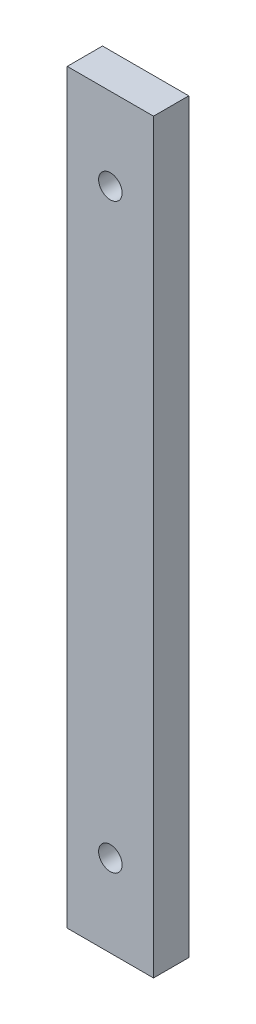
ISO-10303-21;
HEADER;
FILE_DESCRIPTION(('STEP AP214'),'2;1');
FILE_NAME('part.step','',(''),(''),'','','');
FILE_SCHEMA(('AUTOMOTIVE_DESIGN { 1 0 10303 214 1 1 1 1 }'));
ENDSEC;
DATA;
#1=APPLICATION_CONTEXT('core data for automotive mechanical design processes');
#2=APPLICATION_PROTOCOL_DEFINITION('international standard','automotive_design',2000,#1);
#3=PRODUCT_CONTEXT('',#1,'mechanical');
#4=PRODUCT('Part','Part','',(#3));
#5=PRODUCT_RELATED_PRODUCT_CATEGORY('part','',(#4));
#6=PRODUCT_DEFINITION_FORMATION('','',#4);
#7=PRODUCT_DEFINITION_CONTEXT('part definition',#1,'design');
#8=PRODUCT_DEFINITION('design','',#6,#7);
#9=PRODUCT_DEFINITION_SHAPE('','',#8);
#10=(LENGTH_UNIT() NAMED_UNIT(*) SI_UNIT(.MILLI.,.METRE.));
#11=(NAMED_UNIT(*) PLANE_ANGLE_UNIT() SI_UNIT($,.RADIAN.));
#12=(NAMED_UNIT(*) SI_UNIT($,.STERADIAN.) SOLID_ANGLE_UNIT());
#13=UNCERTAINTY_MEASURE_WITH_UNIT(LENGTH_MEASURE(1.E-05),#10,'distance_accuracy_value','');
#14=(GEOMETRIC_REPRESENTATION_CONTEXT(3) GLOBAL_UNCERTAINTY_ASSIGNED_CONTEXT((#13)) GLOBAL_UNIT_ASSIGNED_CONTEXT((#10,
#11,#12)) REPRESENTATION_CONTEXT('',''));
#15=CARTESIAN_POINT('',(0.,0.,0.));
#16=DIRECTION('',(0.,0.,1.));
#17=DIRECTION('',(1.,0.,0.));
#18=AXIS2_PLACEMENT_3D('',#15,#16,#17);
#19=CARTESIAN_POINT('',(0.,0.,6.));
#20=DIRECTION('',(0.,0.,1.));
#21=DIRECTION('',(1.,0.,0.));
#22=AXIS2_PLACEMENT_3D('',#19,#20,#21);
#23=PLANE('',#22);
#24=CARTESIAN_POINT('',(0.,49.5,6.));
#25=DIRECTION('',(0.,0.,1.));
#26=DIRECTION('',(1.,0.,0.));
#27=AXIS2_PLACEMENT_3D('',#24,#25,#26);
#28=CIRCLE('',#27,2.);
#29=CARTESIAN_POINT('',(2.,49.5,6.));
#30=VERTEX_POINT('',#29);
#31=EDGE_CURVE('E112',#30,#30,#28,.F.);
#32=ORIENTED_EDGE('',*,*,#31,.T.);
#33=EDGE_LOOP('',(#32));
#34=FACE_BOUND('',#33,.T.);
#35=DIRECTION('',(0.,1.,0.));
#36=VECTOR('',#35,1.);
#37=CARTESIAN_POINT('',(7.33999999999999,63.5,6.));
#38=LINE('',#37,#36);
#39=CARTESIAN_POINT('',(7.34000000000001,-63.5,6.));
#40=VERTEX_POINT('',#39);
#41=CARTESIAN_POINT('',(7.33999999999999,63.5,6.));
#42=VERTEX_POINT('',#41);
#43=EDGE_CURVE('E85',#40,#42,#38,.T.);
#44=ORIENTED_EDGE('',*,*,#43,.T.);
#45=DIRECTION('',(-1.,0.,0.));
#46=VECTOR('',#45,1.);
#47=CARTESIAN_POINT('',(-7.34000000000001,63.5,6.));
#48=LINE('',#47,#46);
#49=CARTESIAN_POINT('',(-7.34000000000001,63.5,6.));
#50=VERTEX_POINT('',#49);
#51=EDGE_CURVE('E80',#42,#50,#48,.T.);
#52=ORIENTED_EDGE('',*,*,#51,.T.);
#53=DIRECTION('',(0.,-1.,0.));
#54=VECTOR('',#53,1.);
#55=CARTESIAN_POINT('',(-7.34000000000001,63.5,6.));
#56=LINE('',#55,#54);
#57=CARTESIAN_POINT('',(-7.33999999999999,-63.5,6.));
#58=VERTEX_POINT('',#57);
#59=EDGE_CURVE('E83',#50,#58,#56,.T.);
#60=ORIENTED_EDGE('',*,*,#59,.T.);
#61=DIRECTION('',(1.,0.,0.));
#62=VECTOR('',#61,1.);
#63=CARTESIAN_POINT('',(-7.33999999999999,-63.5,6.));
#64=LINE('',#63,#62);
#65=EDGE_CURVE('E50',#58,#40,#64,.T.);
#66=ORIENTED_EDGE('',*,*,#65,.T.);
#67=EDGE_LOOP('',(#44,#52,#60,#66));
#68=FACE_BOUND('',#67,.T.);
#69=CARTESIAN_POINT('',(0.,-49.5,6.));
#70=DIRECTION('',(0.,0.,1.));
#71=DIRECTION('',(1.,0.,0.));
#72=AXIS2_PLACEMENT_3D('',#69,#70,#71);
#73=CIRCLE('',#72,2.);
#74=CARTESIAN_POINT('',(2.,-49.5,6.));
#75=VERTEX_POINT('',#74);
#76=EDGE_CURVE('E118',#75,#75,#73,.T.);
#77=ORIENTED_EDGE('',*,*,#76,.F.);
#78=EDGE_LOOP('',(#77));
#79=FACE_BOUND('',#78,.T.);
#80=ADVANCED_FACE('F33',(#34,#68,#79),#23,.T.);
#81=CARTESIAN_POINT('',(0.,0.,0.));
#82=DIRECTION('',(0.,0.,1.));
#83=DIRECTION('',(1.,0.,0.));
#84=AXIS2_PLACEMENT_3D('',#81,#82,#83);
#85=PLANE('',#84);
#86=DIRECTION('',(0.,1.,0.));
#87=VECTOR('',#86,1.);
#88=CARTESIAN_POINT('',(7.33999999999999,63.5,0.));
#89=LINE('',#88,#87);
#90=CARTESIAN_POINT('',(7.34000000000001,-63.5,0.));
#91=VERTEX_POINT('',#90);
#92=CARTESIAN_POINT('',(7.33999999999999,63.5,0.));
#93=VERTEX_POINT('',#92);
#94=EDGE_CURVE('E97',#91,#93,#89,.T.);
#95=ORIENTED_EDGE('',*,*,#94,.F.);
#96=DIRECTION('',(1.,0.,0.));
#97=VECTOR('',#96,1.);
#98=CARTESIAN_POINT('',(-7.33999999999999,-63.5,0.));
#99=LINE('',#98,#97);
#100=CARTESIAN_POINT('',(-7.33999999999999,-63.5,0.));
#101=VERTEX_POINT('',#100);
#102=EDGE_CURVE('E73',#101,#91,#99,.T.);
#103=ORIENTED_EDGE('',*,*,#102,.F.);
#104=DIRECTION('',(0.,-1.,0.));
#105=VECTOR('',#104,1.);
#106=CARTESIAN_POINT('',(-7.34000000000001,63.5,0.));
#107=LINE('',#106,#105);
#108=CARTESIAN_POINT('',(-7.34000000000001,63.5,0.));
#109=VERTEX_POINT('',#108);
#110=EDGE_CURVE('E67',#109,#101,#107,.T.);
#111=ORIENTED_EDGE('',*,*,#110,.F.);
#112=DIRECTION('',(-1.,0.,0.));
#113=VECTOR('',#112,1.);
#114=CARTESIAN_POINT('',(-7.34000000000001,63.5,0.));
#115=LINE('',#114,#113);
#116=EDGE_CURVE('E89',#93,#109,#115,.T.);
#117=ORIENTED_EDGE('',*,*,#116,.F.);
#118=EDGE_LOOP('',(#95,#103,#111,#117));
#119=FACE_BOUND('',#118,.T.);
#120=CARTESIAN_POINT('',(0.,49.5,0.));
#121=DIRECTION('',(0.,0.,1.));
#122=DIRECTION('',(1.,0.,0.));
#123=AXIS2_PLACEMENT_3D('',#120,#121,#122);
#124=CIRCLE('',#123,2.);
#125=CARTESIAN_POINT('',(2.,49.5,0.));
#126=VERTEX_POINT('',#125);
#127=EDGE_CURVE('E115',#126,#126,#124,.F.);
#128=ORIENTED_EDGE('',*,*,#127,.F.);
#129=EDGE_LOOP('',(#128));
#130=FACE_BOUND('',#129,.T.);
#131=CARTESIAN_POINT('',(0.,-49.5,0.));
#132=DIRECTION('',(0.,0.,1.));
#133=DIRECTION('',(1.,0.,0.));
#134=AXIS2_PLACEMENT_3D('',#131,#132,#133);
#135=CIRCLE('',#134,2.);
#136=CARTESIAN_POINT('',(2.,-49.5,0.));
#137=VERTEX_POINT('',#136);
#138=EDGE_CURVE('E100',#137,#137,#135,.T.);
#139=ORIENTED_EDGE('',*,*,#138,.T.);
#140=EDGE_LOOP('',(#139));
#141=FACE_BOUND('',#140,.T.);
#142=ADVANCED_FACE('F108',(#119,#130,#141),#85,.F.);
#143=CARTESIAN_POINT('',(7.33999999999999,63.5,6.));
#144=DIRECTION('',(-1.,0.,0.));
#145=DIRECTION('',(0.,-1.,0.));
#146=AXIS2_PLACEMENT_3D('',#143,#144,#145);
#147=PLANE('',#146);
#148=ORIENTED_EDGE('',*,*,#94,.T.);
#149=DIRECTION('',(0.,0.,-1.));
#150=VECTOR('',#149,1.);
#151=CARTESIAN_POINT('',(7.33999999999999,63.5,6.));
#152=LINE('',#151,#150);
#153=EDGE_CURVE('E11',#42,#93,#152,.T.);
#154=ORIENTED_EDGE('',*,*,#153,.F.);
#155=ORIENTED_EDGE('',*,*,#43,.F.);
#156=DIRECTION('',(0.,0.,-1.));
#157=VECTOR('',#156,1.);
#158=CARTESIAN_POINT('',(7.34000000000001,-63.5,6.));
#159=LINE('',#158,#157);
#160=EDGE_CURVE('E93',#40,#91,#159,.T.);
#161=ORIENTED_EDGE('',*,*,#160,.T.);
#162=EDGE_LOOP('',(#148,#154,#155,#161));
#163=FACE_BOUND('',#162,.T.);
#164=ADVANCED_FACE('F35',(#163),#147,.F.);
#165=CARTESIAN_POINT('',(-7.34000000000001,63.5,6.));
#166=DIRECTION('',(0.,-1.,0.));
#167=DIRECTION('',(0.,0.,-1.));
#168=AXIS2_PLACEMENT_3D('',#165,#166,#167);
#169=PLANE('',#168);
#170=ORIENTED_EDGE('',*,*,#116,.T.);
#171=DIRECTION('',(0.,0.,-1.));
#172=VECTOR('',#171,1.);
#173=CARTESIAN_POINT('',(-7.34000000000001,63.5,6.));
#174=LINE('',#173,#172);
#175=EDGE_CURVE('E42',#50,#109,#174,.T.);
#176=ORIENTED_EDGE('',*,*,#175,.F.);
#177=ORIENTED_EDGE('',*,*,#51,.F.);
#178=ORIENTED_EDGE('',*,*,#153,.T.);
#179=EDGE_LOOP('',(#170,#176,#177,#178));
#180=FACE_BOUND('',#179,.T.);
#181=ADVANCED_FACE('F88',(#180),#169,.F.);
#182=CARTESIAN_POINT('',(-7.34000000000001,63.5,6.));
#183=DIRECTION('',(1.,0.,0.));
#184=DIRECTION('',(0.,1.,0.));
#185=AXIS2_PLACEMENT_3D('',#182,#183,#184);
#186=PLANE('',#185);
#187=ORIENTED_EDGE('',*,*,#110,.T.);
#188=DIRECTION('',(0.,0.,-1.));
#189=VECTOR('',#188,1.);
#190=CARTESIAN_POINT('',(-7.33999999999999,-63.5,6.));
#191=LINE('',#190,#189);
#192=EDGE_CURVE('E90',#58,#101,#191,.T.);
#193=ORIENTED_EDGE('',*,*,#192,.F.);
#194=ORIENTED_EDGE('',*,*,#59,.F.);
#195=ORIENTED_EDGE('',*,*,#175,.T.);
#196=EDGE_LOOP('',(#187,#193,#194,#195));
#197=FACE_BOUND('',#196,.T.);
#198=ADVANCED_FACE('F91',(#197),#186,.F.);
#199=CARTESIAN_POINT('',(-7.33999999999999,-63.5,6.));
#200=DIRECTION('',(0.,1.,0.));
#201=DIRECTION('',(0.,0.,1.));
#202=AXIS2_PLACEMENT_3D('',#199,#200,#201);
#203=PLANE('',#202);
#204=ORIENTED_EDGE('',*,*,#102,.T.);
#205=ORIENTED_EDGE('',*,*,#160,.F.);
#206=ORIENTED_EDGE('',*,*,#65,.F.);
#207=ORIENTED_EDGE('',*,*,#192,.T.);
#208=EDGE_LOOP('',(#204,#205,#206,#207));
#209=FACE_BOUND('',#208,.T.);
#210=ADVANCED_FACE('F105',(#209),#203,.F.);
#211=CARTESIAN_POINT('',(0.,49.5,0.));
#212=DIRECTION('',(0.,0.,1.));
#213=DIRECTION('',(1.,0.,0.));
#214=AXIS2_PLACEMENT_3D('',#211,#212,#213);
#215=CYLINDRICAL_SURFACE('',#214,2.);
#216=ORIENTED_EDGE('',*,*,#127,.T.);
#217=EDGE_LOOP('',(#216));
#218=FACE_BOUND('',#217,.T.);
#219=ORIENTED_EDGE('',*,*,#31,.F.);
#220=EDGE_LOOP('',(#219));
#221=FACE_BOUND('',#220,.T.);
#222=ADVANCED_FACE('F128',(#218,#221),#215,.F.);
#223=CARTESIAN_POINT('',(0.,-49.5,0.));
#224=DIRECTION('',(0.,0.,1.));
#225=DIRECTION('',(1.,0.,0.));
#226=AXIS2_PLACEMENT_3D('',#223,#224,#225);
#227=CYLINDRICAL_SURFACE('',#226,2.);
#228=ORIENTED_EDGE('',*,*,#138,.F.);
#229=EDGE_LOOP('',(#228));
#230=FACE_BOUND('',#229,.T.);
#231=ORIENTED_EDGE('',*,*,#76,.T.);
#232=EDGE_LOOP('',(#231));
#233=FACE_BOUND('',#232,.T.);
#234=ADVANCED_FACE('F125',(#230,#233),#227,.F.);
#235=CLOSED_SHELL('',(#80,#142,#164,#181,#198,#210,#222,#234));
#236=MANIFOLD_SOLID_BREP('B2',#235);
#237=ADVANCED_BREP_SHAPE_REPRESENTATION('',(#18,#236),#14);
#238=SHAPE_DEFINITION_REPRESENTATION(#9,#237);
ENDSEC;
END-ISO-10303-21;
